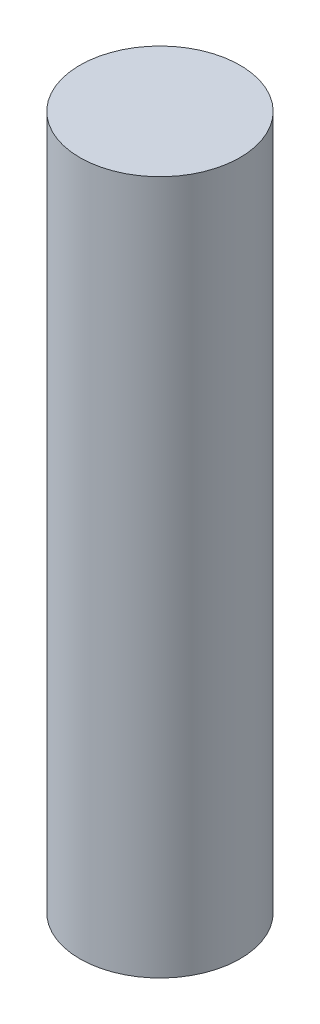
ISO-10303-21;
HEADER;
FILE_DESCRIPTION(('STEP AP214'),'2;1');
FILE_NAME('part.step','',(''),(''),'','','');
FILE_SCHEMA(('AUTOMOTIVE_DESIGN { 1 0 10303 214 1 1 1 1 }'));
ENDSEC;
DATA;
#1=APPLICATION_CONTEXT('core data for automotive mechanical design processes');
#2=APPLICATION_PROTOCOL_DEFINITION('international standard','automotive_design',2000,#1);
#3=PRODUCT_CONTEXT('',#1,'mechanical');
#4=PRODUCT('Part','Part','',(#3));
#5=PRODUCT_RELATED_PRODUCT_CATEGORY('part','',(#4));
#6=PRODUCT_DEFINITION_FORMATION('','',#4);
#7=PRODUCT_DEFINITION_CONTEXT('part definition',#1,'design');
#8=PRODUCT_DEFINITION('design','',#6,#7);
#9=PRODUCT_DEFINITION_SHAPE('','',#8);
#10=(LENGTH_UNIT() NAMED_UNIT(*) SI_UNIT(.MILLI.,.METRE.));
#11=(NAMED_UNIT(*) PLANE_ANGLE_UNIT() SI_UNIT($,.RADIAN.));
#12=(NAMED_UNIT(*) SI_UNIT($,.STERADIAN.) SOLID_ANGLE_UNIT());
#13=UNCERTAINTY_MEASURE_WITH_UNIT(LENGTH_MEASURE(1.E-05),#10,'distance_accuracy_value','');
#14=(GEOMETRIC_REPRESENTATION_CONTEXT(3) GLOBAL_UNCERTAINTY_ASSIGNED_CONTEXT((#13)) GLOBAL_UNIT_ASSIGNED_CONTEXT((#10,
#11,#12)) REPRESENTATION_CONTEXT('',''));
#15=CARTESIAN_POINT('',(0.,0.,0.));
#16=DIRECTION('',(0.,0.,1.));
#17=DIRECTION('',(1.,0.,0.));
#18=AXIS2_PLACEMENT_3D('',#15,#16,#17);
#19=CARTESIAN_POINT('',(0.,26.,0.));
#20=DIRECTION('',(0.,-1.,0.));
#21=DIRECTION('',(0.,0.,-1.));
#22=AXIS2_PLACEMENT_3D('',#19,#20,#21);
#23=CYLINDRICAL_SURFACE('',#22,3.);
#24=CARTESIAN_POINT('',(0.,26.,0.));
#25=DIRECTION('',(0.,1.,0.));
#26=DIRECTION('',(0.,0.,1.));
#27=AXIS2_PLACEMENT_3D('',#24,#25,#26);
#28=CIRCLE('',#27,3.);
#29=CARTESIAN_POINT('',(0.,26.,3.));
#30=VERTEX_POINT('',#29);
#31=EDGE_CURVE('E10',#30,#30,#28,.T.);
#32=ORIENTED_EDGE('',*,*,#31,.F.);
#33=EDGE_LOOP('',(#32));
#34=FACE_BOUND('',#33,.T.);
#35=CARTESIAN_POINT('',(0.,0.,0.));
#36=DIRECTION('',(0.,1.,0.));
#37=DIRECTION('',(0.,0.,1.));
#38=AXIS2_PLACEMENT_3D('',#35,#36,#37);
#39=CIRCLE('',#38,3.);
#40=CARTESIAN_POINT('',(0.,0.,3.));
#41=VERTEX_POINT('',#40);
#42=EDGE_CURVE('E44',#41,#41,#39,.T.);
#43=ORIENTED_EDGE('',*,*,#42,.T.);
#44=EDGE_LOOP('',(#43));
#45=FACE_BOUND('',#44,.T.);
#46=ADVANCED_FACE('F41',(#34,#45),#23,.T.);
#47=CARTESIAN_POINT('',(0.,26.,0.));
#48=DIRECTION('',(0.,1.,0.));
#49=DIRECTION('',(0.,0.,1.));
#50=AXIS2_PLACEMENT_3D('',#47,#48,#49);
#51=PLANE('',#50);
#52=ORIENTED_EDGE('',*,*,#31,.T.);
#53=EDGE_LOOP('',(#52));
#54=FACE_BOUND('',#53,.T.);
#55=ADVANCED_FACE('F58',(#54),#51,.T.);
#56=CARTESIAN_POINT('',(0.,0.,0.));
#57=DIRECTION('',(0.,1.,0.));
#58=DIRECTION('',(0.,0.,1.));
#59=AXIS2_PLACEMENT_3D('',#56,#57,#58);
#60=PLANE('',#59);
#61=ORIENTED_EDGE('',*,*,#42,.F.);
#62=EDGE_LOOP('',(#61));
#63=FACE_BOUND('',#62,.T.);
#64=ADVANCED_FACE('F56',(#63),#60,.F.);
#65=CLOSED_SHELL('',(#46,#55,#64));
#66=MANIFOLD_SOLID_BREP('B2',#65);
#67=ADVANCED_BREP_SHAPE_REPRESENTATION('',(#18,#66),#14);
#68=SHAPE_DEFINITION_REPRESENTATION(#9,#67);
ENDSEC;
END-ISO-10303-21;
